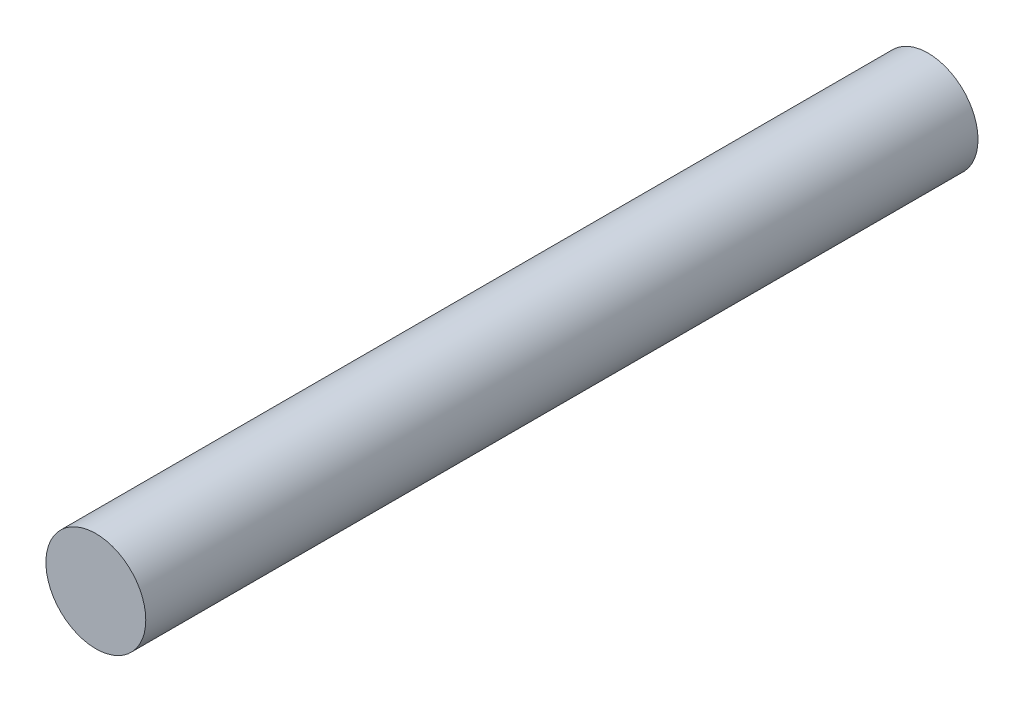
ISO-10303-21;
HEADER;
FILE_DESCRIPTION(('STEP AP214'),'2;1');
FILE_NAME('part.step','',(''),(''),'','','');
FILE_SCHEMA(('AUTOMOTIVE_DESIGN { 1 0 10303 214 1 1 1 1 }'));
ENDSEC;
DATA;
#1=APPLICATION_CONTEXT('core data for automotive mechanical design processes');
#2=APPLICATION_PROTOCOL_DEFINITION('international standard','automotive_design',2000,#1);
#3=PRODUCT_CONTEXT('',#1,'mechanical');
#4=PRODUCT('Part','Part','',(#3));
#5=PRODUCT_RELATED_PRODUCT_CATEGORY('part','',(#4));
#6=PRODUCT_DEFINITION_FORMATION('','',#4);
#7=PRODUCT_DEFINITION_CONTEXT('part definition',#1,'design');
#8=PRODUCT_DEFINITION('design','',#6,#7);
#9=PRODUCT_DEFINITION_SHAPE('','',#8);
#10=(LENGTH_UNIT() NAMED_UNIT(*) SI_UNIT(.MILLI.,.METRE.));
#11=(NAMED_UNIT(*) PLANE_ANGLE_UNIT() SI_UNIT($,.RADIAN.));
#12=(NAMED_UNIT(*) SI_UNIT($,.STERADIAN.) SOLID_ANGLE_UNIT());
#13=UNCERTAINTY_MEASURE_WITH_UNIT(LENGTH_MEASURE(1.E-05),#10,'distance_accuracy_value','');
#14=(GEOMETRIC_REPRESENTATION_CONTEXT(3) GLOBAL_UNCERTAINTY_ASSIGNED_CONTEXT((#13)) GLOBAL_UNIT_ASSIGNED_CONTEXT((#10,
#11,#12)) REPRESENTATION_CONTEXT('',''));
#15=CARTESIAN_POINT('',(0.,0.,0.));
#16=DIRECTION('',(0.,0.,1.));
#17=DIRECTION('',(1.,0.,0.));
#18=AXIS2_PLACEMENT_3D('',#15,#16,#17);
#19=CARTESIAN_POINT('',(0.,0.,25.));
#20=DIRECTION('',(0.,0.,-1.));
#21=DIRECTION('',(-1.,0.,0.));
#22=AXIS2_PLACEMENT_3D('',#19,#20,#21);
#23=CYLINDRICAL_SURFACE('',#22,1.5);
#24=CARTESIAN_POINT('',(0.,0.,25.));
#25=DIRECTION('',(0.,0.,1.));
#26=DIRECTION('',(1.,0.,0.));
#27=AXIS2_PLACEMENT_3D('',#24,#25,#26);
#28=CIRCLE('',#27,1.5);
#29=CARTESIAN_POINT('',(1.5,0.,25.));
#30=VERTEX_POINT('',#29);
#31=EDGE_CURVE('E10',#30,#30,#28,.T.);
#32=ORIENTED_EDGE('',*,*,#31,.F.);
#33=EDGE_LOOP('',(#32));
#34=FACE_BOUND('',#33,.T.);
#35=CARTESIAN_POINT('',(0.,0.,0.));
#36=DIRECTION('',(0.,0.,1.));
#37=DIRECTION('',(1.,0.,0.));
#38=AXIS2_PLACEMENT_3D('',#35,#36,#37);
#39=CIRCLE('',#38,1.5);
#40=CARTESIAN_POINT('',(1.5,0.,0.));
#41=VERTEX_POINT('',#40);
#42=EDGE_CURVE('E36',#41,#41,#39,.T.);
#43=ORIENTED_EDGE('',*,*,#42,.T.);
#44=EDGE_LOOP('',(#43));
#45=FACE_BOUND('',#44,.T.);
#46=ADVANCED_FACE('F33',(#34,#45),#23,.T.);
#47=CARTESIAN_POINT('',(0.,0.,25.));
#48=DIRECTION('',(0.,0.,1.));
#49=DIRECTION('',(1.,0.,0.));
#50=AXIS2_PLACEMENT_3D('',#47,#48,#49);
#51=PLANE('',#50);
#52=ORIENTED_EDGE('',*,*,#31,.T.);
#53=EDGE_LOOP('',(#52));
#54=FACE_BOUND('',#53,.T.);
#55=ADVANCED_FACE('F48',(#54),#51,.T.);
#56=CARTESIAN_POINT('',(0.,0.,0.));
#57=DIRECTION('',(0.,0.,1.));
#58=DIRECTION('',(1.,0.,0.));
#59=AXIS2_PLACEMENT_3D('',#56,#57,#58);
#60=PLANE('',#59);
#61=ORIENTED_EDGE('',*,*,#42,.F.);
#62=EDGE_LOOP('',(#61));
#63=FACE_BOUND('',#62,.T.);
#64=ADVANCED_FACE('F46',(#63),#60,.F.);
#65=CLOSED_SHELL('',(#46,#55,#64));
#66=MANIFOLD_SOLID_BREP('B2',#65);
#67=ADVANCED_BREP_SHAPE_REPRESENTATION('',(#18,#66),#14);
#68=SHAPE_DEFINITION_REPRESENTATION(#9,#67);
ENDSEC;
END-ISO-10303-21;
